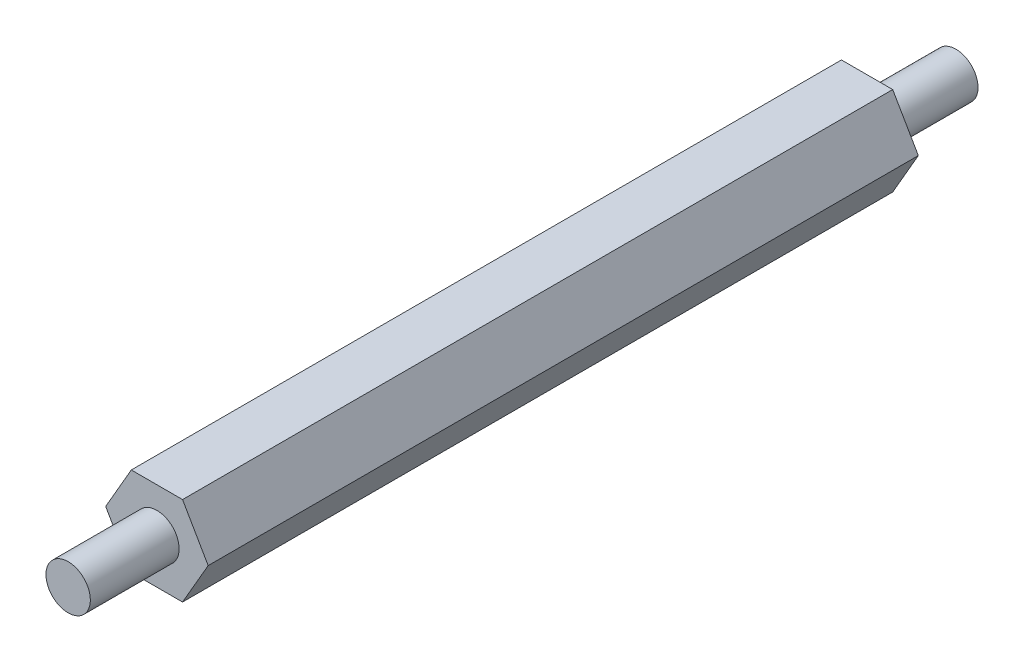
ISO-10303-21;
HEADER;
FILE_DESCRIPTION(('STEP AP214'),'2;1');
FILE_NAME('part.step','',(''),(''),'','','');
FILE_SCHEMA(('AUTOMOTIVE_DESIGN { 1 0 10303 214 1 1 1 1 }'));
ENDSEC;
DATA;
#1=APPLICATION_CONTEXT('core data for automotive mechanical design processes');
#2=APPLICATION_PROTOCOL_DEFINITION('international standard','automotive_design',2000,#1);
#3=PRODUCT_CONTEXT('',#1,'mechanical');
#4=PRODUCT('Part','Part','',(#3));
#5=PRODUCT_RELATED_PRODUCT_CATEGORY('part','',(#4));
#6=PRODUCT_DEFINITION_FORMATION('','',#4);
#7=PRODUCT_DEFINITION_CONTEXT('part definition',#1,'design');
#8=PRODUCT_DEFINITION('design','',#6,#7);
#9=PRODUCT_DEFINITION_SHAPE('','',#8);
#10=(LENGTH_UNIT() NAMED_UNIT(*) SI_UNIT(.MILLI.,.METRE.));
#11=(NAMED_UNIT(*) PLANE_ANGLE_UNIT() SI_UNIT($,.RADIAN.));
#12=(NAMED_UNIT(*) SI_UNIT($,.STERADIAN.) SOLID_ANGLE_UNIT());
#13=UNCERTAINTY_MEASURE_WITH_UNIT(LENGTH_MEASURE(1.E-05),#10,'distance_accuracy_value','');
#14=(GEOMETRIC_REPRESENTATION_CONTEXT(3) GLOBAL_UNCERTAINTY_ASSIGNED_CONTEXT((#13)) GLOBAL_UNIT_ASSIGNED_CONTEXT((#10,
#11,#12)) REPRESENTATION_CONTEXT('',''));
#15=CARTESIAN_POINT('',(0.,0.,0.));
#16=DIRECTION('',(0.,0.,1.));
#17=DIRECTION('',(1.,0.,0.));
#18=AXIS2_PLACEMENT_3D('',#15,#16,#17);
#19=CARTESIAN_POINT('',(1.73205080756891,-2.99999999999997,-48.));
#20=DIRECTION('',(0.866025403784441,-0.499999999999995,0.));
#21=DIRECTION('',(0.499999999999995,0.866025403784442,0.));
#22=AXIS2_PLACEMENT_3D('',#19,#20,#21);
#23=PLANE('',#22);
#24=DIRECTION('',(0.499999999999995,0.866025403784442,0.));
#25=VECTOR('',#24,1.);
#26=CARTESIAN_POINT('',(1.73205080756891,-2.99999999999997,0.));
#27=LINE('',#26,#25);
#28=CARTESIAN_POINT('',(1.73205080756891,-2.99999999999997,0.));
#29=VERTEX_POINT('',#28);
#30=CARTESIAN_POINT('',(3.46410161513774,0.,0.));
#31=VERTEX_POINT('',#30);
#32=EDGE_CURVE('E127',#29,#31,#27,.T.);
#33=ORIENTED_EDGE('',*,*,#32,.F.);
#34=DIRECTION('',(0.,0.,1.));
#35=VECTOR('',#34,1.);
#36=CARTESIAN_POINT('',(1.73205080756891,-2.99999999999997,-48.));
#37=LINE('',#36,#35);
#38=CARTESIAN_POINT('',(1.73205080756891,-2.99999999999997,-48.));
#39=VERTEX_POINT('',#38);
#40=EDGE_CURVE('E57',#39,#29,#37,.T.);
#41=ORIENTED_EDGE('',*,*,#40,.F.);
#42=DIRECTION('',(0.499999999999995,0.866025403784442,0.));
#43=VECTOR('',#42,1.);
#44=CARTESIAN_POINT('',(1.73205080756891,-2.99999999999997,-48.));
#45=LINE('',#44,#43);
#46=CARTESIAN_POINT('',(3.46410161513774,0.,-48.));
#47=VERTEX_POINT('',#46);
#48=EDGE_CURVE('E143',#39,#47,#45,.T.);
#49=ORIENTED_EDGE('',*,*,#48,.T.);
#50=DIRECTION('',(0.,0.,1.));
#51=VECTOR('',#50,1.);
#52=CARTESIAN_POINT('',(3.46410161513774,0.,-48.));
#53=LINE('',#52,#51);
#54=EDGE_CURVE('E42',#47,#31,#53,.T.);
#55=ORIENTED_EDGE('',*,*,#54,.T.);
#56=EDGE_LOOP('',(#33,#41,#49,#55));
#57=FACE_BOUND('',#56,.T.);
#58=ADVANCED_FACE('F39',(#57),#23,.T.);
#59=CARTESIAN_POINT('',(-1.73205080756884,-3.00000000000001,-48.));
#60=DIRECTION('',(0.,-1.,0.));
#61=DIRECTION('',(1.,0.,0.));
#62=AXIS2_PLACEMENT_3D('',#59,#60,#61);
#63=PLANE('',#62);
#64=DIRECTION('',(1.,0.,0.));
#65=VECTOR('',#64,1.);
#66=CARTESIAN_POINT('',(-1.73205080756884,-3.00000000000001,0.));
#67=LINE('',#66,#65);
#68=CARTESIAN_POINT('',(-1.73205080756884,-3.00000000000001,0.));
#69=VERTEX_POINT('',#68);
#70=EDGE_CURVE('E140',#69,#29,#67,.T.);
#71=ORIENTED_EDGE('',*,*,#70,.F.);
#72=DIRECTION('',(0.,0.,1.));
#73=VECTOR('',#72,1.);
#74=CARTESIAN_POINT('',(-1.73205080756884,-3.00000000000001,-48.));
#75=LINE('',#74,#73);
#76=CARTESIAN_POINT('',(-1.73205080756884,-3.00000000000001,-48.));
#77=VERTEX_POINT('',#76);
#78=EDGE_CURVE('E80',#77,#69,#75,.T.);
#79=ORIENTED_EDGE('',*,*,#78,.F.);
#80=DIRECTION('',(1.,0.,0.));
#81=VECTOR('',#80,1.);
#82=CARTESIAN_POINT('',(-1.73205080756884,-3.00000000000001,-48.));
#83=LINE('',#82,#81);
#84=EDGE_CURVE('E117',#77,#39,#83,.T.);
#85=ORIENTED_EDGE('',*,*,#84,.T.);
#86=ORIENTED_EDGE('',*,*,#40,.T.);
#87=EDGE_LOOP('',(#71,#79,#85,#86));
#88=FACE_BOUND('',#87,.T.);
#89=ADVANCED_FACE('F151',(#88),#63,.T.);
#90=CARTESIAN_POINT('',(-3.46410161513774,0.,-48.));
#91=DIRECTION('',(-0.866025403784434,-0.500000000000007,0.));
#92=DIRECTION('',(0.500000000000007,-0.866025403784435,0.));
#93=AXIS2_PLACEMENT_3D('',#90,#91,#92);
#94=PLANE('',#93);
#95=DIRECTION('',(0.500000000000007,-0.866025403784435,0.));
#96=VECTOR('',#95,1.);
#97=CARTESIAN_POINT('',(-3.46410161513774,0.,0.));
#98=LINE('',#97,#96);
#99=CARTESIAN_POINT('',(-3.46410161513774,0.,0.));
#100=VERTEX_POINT('',#99);
#101=EDGE_CURVE('E104',#100,#69,#98,.T.);
#102=ORIENTED_EDGE('',*,*,#101,.F.);
#103=DIRECTION('',(0.,0.,1.));
#104=VECTOR('',#103,1.);
#105=CARTESIAN_POINT('',(-3.46410161513774,0.,-48.));
#106=LINE('',#105,#104);
#107=CARTESIAN_POINT('',(-3.46410161513774,0.,-48.));
#108=VERTEX_POINT('',#107);
#109=EDGE_CURVE('E99',#108,#100,#106,.T.);
#110=ORIENTED_EDGE('',*,*,#109,.F.);
#111=DIRECTION('',(0.500000000000007,-0.866025403784435,0.));
#112=VECTOR('',#111,1.);
#113=CARTESIAN_POINT('',(-3.46410161513774,0.,-48.));
#114=LINE('',#113,#112);
#115=EDGE_CURVE('E102',#108,#77,#114,.T.);
#116=ORIENTED_EDGE('',*,*,#115,.T.);
#117=ORIENTED_EDGE('',*,*,#78,.T.);
#118=EDGE_LOOP('',(#102,#110,#116,#117));
#119=FACE_BOUND('',#118,.T.);
#120=ADVANCED_FACE('F101',(#119),#94,.T.);
#121=CARTESIAN_POINT('',(-1.73205080756888,2.99999999999998,-48.));
#122=DIRECTION('',(-0.866025403784441,0.499999999999995,0.));
#123=DIRECTION('',(-0.499999999999995,-0.866025403784442,0.));
#124=AXIS2_PLACEMENT_3D('',#121,#122,#123);
#125=PLANE('',#124);
#126=DIRECTION('',(-0.499999999999995,-0.866025403784441,0.));
#127=VECTOR('',#126,1.);
#128=CARTESIAN_POINT('',(-1.73205080756888,2.99999999999998,0.));
#129=LINE('',#128,#127);
#130=CARTESIAN_POINT('',(-1.73205080756888,2.99999999999998,0.));
#131=VERTEX_POINT('',#130);
#132=EDGE_CURVE('E137',#131,#100,#129,.T.);
#133=ORIENTED_EDGE('',*,*,#132,.F.);
#134=DIRECTION('',(0.,0.,1.));
#135=VECTOR('',#134,1.);
#136=CARTESIAN_POINT('',(-1.73205080756888,2.99999999999998,-48.));
#137=LINE('',#136,#135);
#138=CARTESIAN_POINT('',(-1.73205080756888,2.99999999999998,-48.));
#139=VERTEX_POINT('',#138);
#140=EDGE_CURVE('E109',#139,#131,#137,.T.);
#141=ORIENTED_EDGE('',*,*,#140,.F.);
#142=DIRECTION('',(-0.499999999999995,-0.866025403784441,0.));
#143=VECTOR('',#142,1.);
#144=CARTESIAN_POINT('',(-1.73205080756888,2.99999999999998,-48.));
#145=LINE('',#144,#143);
#146=EDGE_CURVE('E115',#139,#108,#145,.T.);
#147=ORIENTED_EDGE('',*,*,#146,.T.);
#148=ORIENTED_EDGE('',*,*,#109,.T.);
#149=EDGE_LOOP('',(#133,#141,#147,#148));
#150=FACE_BOUND('',#149,.T.);
#151=ADVANCED_FACE('F119',(#150),#125,.T.);
#152=CARTESIAN_POINT('',(1.73205080756886,2.99999999999999,-48.));
#153=DIRECTION('',(0.,1.,0.));
#154=DIRECTION('',(-1.,0.,0.));
#155=AXIS2_PLACEMENT_3D('',#152,#153,#154);
#156=PLANE('',#155);
#157=DIRECTION('',(-1.,0.,0.));
#158=VECTOR('',#157,1.);
#159=CARTESIAN_POINT('',(1.73205080756886,2.99999999999999,0.));
#160=LINE('',#159,#158);
#161=CARTESIAN_POINT('',(1.73205080756886,2.99999999999999,0.));
#162=VERTEX_POINT('',#161);
#163=EDGE_CURVE('E134',#162,#131,#160,.T.);
#164=ORIENTED_EDGE('',*,*,#163,.F.);
#165=DIRECTION('',(0.,0.,1.));
#166=VECTOR('',#165,1.);
#167=CARTESIAN_POINT('',(1.73205080756886,2.99999999999999,-48.));
#168=LINE('',#167,#166);
#169=CARTESIAN_POINT('',(1.73205080756886,2.99999999999999,-48.));
#170=VERTEX_POINT('',#169);
#171=EDGE_CURVE('E146',#170,#162,#168,.T.);
#172=ORIENTED_EDGE('',*,*,#171,.F.);
#173=DIRECTION('',(-1.,0.,0.));
#174=VECTOR('',#173,1.);
#175=CARTESIAN_POINT('',(1.73205080756886,2.99999999999999,-48.));
#176=LINE('',#175,#174);
#177=EDGE_CURVE('E120',#170,#139,#176,.T.);
#178=ORIENTED_EDGE('',*,*,#177,.T.);
#179=ORIENTED_EDGE('',*,*,#140,.T.);
#180=EDGE_LOOP('',(#164,#172,#178,#179));
#181=FACE_BOUND('',#180,.T.);
#182=ADVANCED_FACE('F164',(#181),#156,.T.);
#183=CARTESIAN_POINT('',(3.46410161513774,0.,-48.));
#184=DIRECTION('',(0.866025403784438,0.500000000000001,0.));
#185=DIRECTION('',(-0.500000000000001,0.866025403784438,0.));
#186=AXIS2_PLACEMENT_3D('',#183,#184,#185);
#187=PLANE('',#186);
#188=DIRECTION('',(-0.500000000000001,0.866025403784438,0.));
#189=VECTOR('',#188,1.);
#190=CARTESIAN_POINT('',(3.46410161513774,0.,0.));
#191=LINE('',#190,#189);
#192=EDGE_CURVE('E130',#31,#162,#191,.T.);
#193=ORIENTED_EDGE('',*,*,#192,.F.);
#194=ORIENTED_EDGE('',*,*,#54,.F.);
#195=DIRECTION('',(-0.500000000000001,0.866025403784438,0.));
#196=VECTOR('',#195,1.);
#197=CARTESIAN_POINT('',(3.46410161513774,0.,-48.));
#198=LINE('',#197,#196);
#199=EDGE_CURVE('E122',#47,#170,#198,.T.);
#200=ORIENTED_EDGE('',*,*,#199,.T.);
#201=ORIENTED_EDGE('',*,*,#171,.T.);
#202=EDGE_LOOP('',(#193,#194,#200,#201));
#203=FACE_BOUND('',#202,.T.);
#204=ADVANCED_FACE('F148',(#203),#187,.T.);
#205=CARTESIAN_POINT('',(0.,0.,-48.));
#206=DIRECTION('',(0.,0.,1.));
#207=DIRECTION('',(1.,0.,0.));
#208=AXIS2_PLACEMENT_3D('',#205,#206,#207);
#209=PLANE('',#208);
#210=CARTESIAN_POINT('',(0.,0.,-48.));
#211=DIRECTION('',(0.,0.,-1.));
#212=DIRECTION('',(-1.,0.,0.));
#213=AXIS2_PLACEMENT_3D('',#210,#211,#212);
#214=CIRCLE('',#213,1.5);
#215=CARTESIAN_POINT('',(-1.5,0.,-48.));
#216=VERTEX_POINT('',#215);
#217=EDGE_CURVE('E11',#216,#216,#214,.T.);
#218=ORIENTED_EDGE('',*,*,#217,.F.);
#219=EDGE_LOOP('',(#218));
#220=FACE_BOUND('',#219,.T.);
#221=ORIENTED_EDGE('',*,*,#48,.F.);
#222=ORIENTED_EDGE('',*,*,#84,.F.);
#223=ORIENTED_EDGE('',*,*,#115,.F.);
#224=ORIENTED_EDGE('',*,*,#146,.F.);
#225=ORIENTED_EDGE('',*,*,#177,.F.);
#226=ORIENTED_EDGE('',*,*,#199,.F.);
#227=EDGE_LOOP('',(#221,#222,#223,#224,#225,#226));
#228=FACE_BOUND('',#227,.T.);
#229=ADVANCED_FACE('F113',(#220,#228),#209,.F.);
#230=CARTESIAN_POINT('',(0.,0.,0.));
#231=DIRECTION('',(0.,0.,1.));
#232=DIRECTION('',(1.,0.,0.));
#233=AXIS2_PLACEMENT_3D('',#230,#231,#232);
#234=PLANE('',#233);
#235=CARTESIAN_POINT('',(0.,0.,0.));
#236=DIRECTION('',(0.,0.,1.));
#237=DIRECTION('',(1.,0.,0.));
#238=AXIS2_PLACEMENT_3D('',#235,#236,#237);
#239=CIRCLE('',#238,1.5);
#240=CARTESIAN_POINT('',(1.5,0.,0.));
#241=VERTEX_POINT('',#240);
#242=EDGE_CURVE('E48',#241,#241,#239,.T.);
#243=ORIENTED_EDGE('',*,*,#242,.F.);
#244=EDGE_LOOP('',(#243));
#245=FACE_BOUND('',#244,.T.);
#246=ORIENTED_EDGE('',*,*,#32,.T.);
#247=ORIENTED_EDGE('',*,*,#192,.T.);
#248=ORIENTED_EDGE('',*,*,#163,.T.);
#249=ORIENTED_EDGE('',*,*,#132,.T.);
#250=ORIENTED_EDGE('',*,*,#101,.T.);
#251=ORIENTED_EDGE('',*,*,#70,.T.);
#252=EDGE_LOOP('',(#246,#247,#248,#249,#250,#251));
#253=FACE_BOUND('',#252,.T.);
#254=ADVANCED_FACE('F150',(#245,#253),#234,.T.);
#255=CARTESIAN_POINT('',(0.,0.,6.));
#256=DIRECTION('',(0.,0.,-1.));
#257=DIRECTION('',(-1.,0.,0.));
#258=AXIS2_PLACEMENT_3D('',#255,#256,#257);
#259=CYLINDRICAL_SURFACE('',#258,1.5);
#260=CARTESIAN_POINT('',(0.,0.,6.));
#261=DIRECTION('',(0.,0.,1.));
#262=DIRECTION('',(1.,0.,0.));
#263=AXIS2_PLACEMENT_3D('',#260,#261,#262);
#264=CIRCLE('',#263,1.5);
#265=CARTESIAN_POINT('',(1.5,0.,6.));
#266=VERTEX_POINT('',#265);
#267=EDGE_CURVE('E131',#266,#266,#264,.T.);
#268=ORIENTED_EDGE('',*,*,#267,.F.);
#269=EDGE_LOOP('',(#268));
#270=FACE_BOUND('',#269,.T.);
#271=ORIENTED_EDGE('',*,*,#242,.T.);
#272=EDGE_LOOP('',(#271));
#273=FACE_BOUND('',#272,.T.);
#274=ADVANCED_FACE('F175',(#270,#273),#259,.T.);
#275=CARTESIAN_POINT('',(0.,0.,6.));
#276=DIRECTION('',(0.,0.,1.));
#277=DIRECTION('',(1.,0.,0.));
#278=AXIS2_PLACEMENT_3D('',#275,#276,#277);
#279=PLANE('',#278);
#280=ORIENTED_EDGE('',*,*,#267,.T.);
#281=EDGE_LOOP('',(#280));
#282=FACE_BOUND('',#281,.T.);
#283=ADVANCED_FACE('F181',(#282),#279,.T.);
#284=CARTESIAN_POINT('',(0.,0.,-54.));
#285=DIRECTION('',(0.,0.,1.));
#286=DIRECTION('',(1.,0.,0.));
#287=AXIS2_PLACEMENT_3D('',#284,#285,#286);
#288=CYLINDRICAL_SURFACE('',#287,1.5);
#289=CARTESIAN_POINT('',(0.,0.,-54.));
#290=DIRECTION('',(0.,0.,-1.));
#291=DIRECTION('',(-1.,0.,0.));
#292=AXIS2_PLACEMENT_3D('',#289,#290,#291);
#293=CIRCLE('',#292,1.5);
#294=CARTESIAN_POINT('',(-1.5,0.,-54.));
#295=VERTEX_POINT('',#294);
#296=EDGE_CURVE('E197',#295,#295,#293,.T.);
#297=ORIENTED_EDGE('',*,*,#296,.F.);
#298=EDGE_LOOP('',(#297));
#299=FACE_BOUND('',#298,.T.);
#300=ORIENTED_EDGE('',*,*,#217,.T.);
#301=EDGE_LOOP('',(#300));
#302=FACE_BOUND('',#301,.T.);
#303=ADVANCED_FACE('F185',(#299,#302),#288,.T.);
#304=CARTESIAN_POINT('',(0.,0.,-54.));
#305=DIRECTION('',(0.,0.,-1.));
#306=DIRECTION('',(-1.,0.,0.));
#307=AXIS2_PLACEMENT_3D('',#304,#305,#306);
#308=PLANE('',#307);
#309=ORIENTED_EDGE('',*,*,#296,.T.);
#310=EDGE_LOOP('',(#309));
#311=FACE_BOUND('',#310,.T.);
#312=ADVANCED_FACE('F189',(#311),#308,.T.);
#313=CLOSED_SHELL('',(#58,#89,#120,#151,#182,#204,#229,#254,#274,#283,#303,#312));
#314=MANIFOLD_SOLID_BREP('B2',#313);
#315=ADVANCED_BREP_SHAPE_REPRESENTATION('',(#18,#314),#14);
#316=SHAPE_DEFINITION_REPRESENTATION(#9,#315);
ENDSEC;
END-ISO-10303-21;
